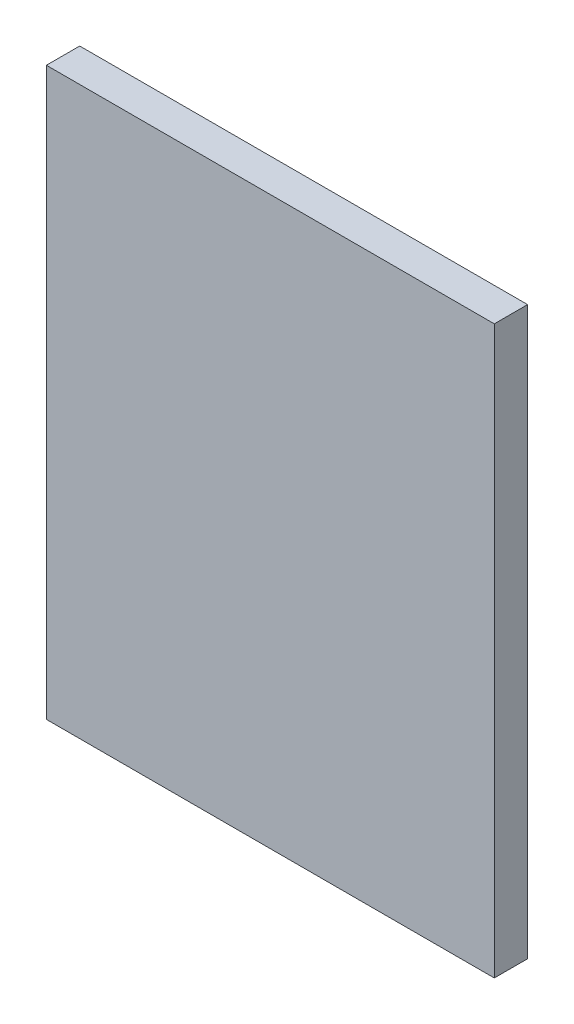
ISO-10303-21;
HEADER;
FILE_DESCRIPTION(('STEP AP214'),'2;1');
FILE_NAME('part.step','',(''),(''),'','','');
FILE_SCHEMA(('AUTOMOTIVE_DESIGN { 1 0 10303 214 1 1 1 1 }'));
ENDSEC;
DATA;
#1=APPLICATION_CONTEXT('core data for automotive mechanical design processes');
#2=APPLICATION_PROTOCOL_DEFINITION('international standard','automotive_design',2000,#1);
#3=PRODUCT_CONTEXT('',#1,'mechanical');
#4=PRODUCT('Part','Part','',(#3));
#5=PRODUCT_RELATED_PRODUCT_CATEGORY('part','',(#4));
#6=PRODUCT_DEFINITION_FORMATION('','',#4);
#7=PRODUCT_DEFINITION_CONTEXT('part definition',#1,'design');
#8=PRODUCT_DEFINITION('design','',#6,#7);
#9=PRODUCT_DEFINITION_SHAPE('','',#8);
#10=(LENGTH_UNIT() NAMED_UNIT(*) SI_UNIT(.MILLI.,.METRE.));
#11=(NAMED_UNIT(*) PLANE_ANGLE_UNIT() SI_UNIT($,.RADIAN.));
#12=(NAMED_UNIT(*) SI_UNIT($,.STERADIAN.) SOLID_ANGLE_UNIT());
#13=UNCERTAINTY_MEASURE_WITH_UNIT(LENGTH_MEASURE(1.E-05),#10,'distance_accuracy_value','');
#14=(GEOMETRIC_REPRESENTATION_CONTEXT(3) GLOBAL_UNCERTAINTY_ASSIGNED_CONTEXT((#13)) GLOBAL_UNIT_ASSIGNED_CONTEXT((#10,
#11,#12)) REPRESENTATION_CONTEXT('',''));
#15=CARTESIAN_POINT('',(0.,0.,0.));
#16=DIRECTION('',(0.,0.,1.));
#17=DIRECTION('',(1.,0.,0.));
#18=AXIS2_PLACEMENT_3D('',#15,#16,#17);
#19=CARTESIAN_POINT('',(21.336,-26.9875,1.5875));
#20=DIRECTION('',(-1.,0.,0.));
#21=DIRECTION('',(0.,0.,1.));
#22=AXIS2_PLACEMENT_3D('',#19,#20,#21);
#23=PLANE('',#22);
#24=DIRECTION('',(0.,1.,0.));
#25=VECTOR('',#24,1.);
#26=CARTESIAN_POINT('',(21.336,-26.9875,-1.5875));
#27=LINE('',#26,#25);
#28=CARTESIAN_POINT('',(21.336,-26.9875,-1.5875));
#29=VERTEX_POINT('',#28);
#30=CARTESIAN_POINT('',(21.336,26.9875,-1.5875));
#31=VERTEX_POINT('',#30);
#32=EDGE_CURVE('E96',#29,#31,#27,.T.);
#33=ORIENTED_EDGE('',*,*,#32,.T.);
#34=DIRECTION('',(0.,0.,-1.));
#35=VECTOR('',#34,1.);
#36=CARTESIAN_POINT('',(21.336,26.9875,1.5875));
#37=LINE('',#36,#35);
#38=CARTESIAN_POINT('',(21.336,26.9875,1.5875));
#39=VERTEX_POINT('',#38);
#40=EDGE_CURVE('E11',#39,#31,#37,.T.);
#41=ORIENTED_EDGE('',*,*,#40,.F.);
#42=DIRECTION('',(0.,1.,0.));
#43=VECTOR('',#42,1.);
#44=CARTESIAN_POINT('',(21.336,-26.9875,1.5875));
#45=LINE('',#44,#43);
#46=CARTESIAN_POINT('',(21.336,-26.9875,1.5875));
#47=VERTEX_POINT('',#46);
#48=EDGE_CURVE('E84',#47,#39,#45,.T.);
#49=ORIENTED_EDGE('',*,*,#48,.F.);
#50=DIRECTION('',(0.,0.,-1.));
#51=VECTOR('',#50,1.);
#52=CARTESIAN_POINT('',(21.336,-26.9875,1.5875));
#53=LINE('',#52,#51);
#54=EDGE_CURVE('E92',#47,#29,#53,.T.);
#55=ORIENTED_EDGE('',*,*,#54,.T.);
#56=EDGE_LOOP('',(#33,#41,#49,#55));
#57=FACE_BOUND('',#56,.T.);
#58=ADVANCED_FACE('F33',(#57),#23,.F.);
#59=CARTESIAN_POINT('',(-21.336,26.9875,1.5875));
#60=DIRECTION('',(0.,-1.,0.));
#61=DIRECTION('',(0.,0.,-1.));
#62=AXIS2_PLACEMENT_3D('',#59,#60,#61);
#63=PLANE('',#62);
#64=DIRECTION('',(-1.,0.,0.));
#65=VECTOR('',#64,1.);
#66=CARTESIAN_POINT('',(-21.336,26.9875,-1.5875));
#67=LINE('',#66,#65);
#68=CARTESIAN_POINT('',(-21.336,26.9875,-1.5875));
#69=VERTEX_POINT('',#68);
#70=EDGE_CURVE('E88',#31,#69,#67,.T.);
#71=ORIENTED_EDGE('',*,*,#70,.T.);
#72=DIRECTION('',(0.,0.,-1.));
#73=VECTOR('',#72,1.);
#74=CARTESIAN_POINT('',(-21.336,26.9875,1.5875));
#75=LINE('',#74,#73);
#76=CARTESIAN_POINT('',(-21.336,26.9875,1.5875));
#77=VERTEX_POINT('',#76);
#78=EDGE_CURVE('E41',#77,#69,#75,.T.);
#79=ORIENTED_EDGE('',*,*,#78,.F.);
#80=DIRECTION('',(-1.,0.,0.));
#81=VECTOR('',#80,1.);
#82=CARTESIAN_POINT('',(-21.336,26.9875,1.5875));
#83=LINE('',#82,#81);
#84=EDGE_CURVE('E79',#39,#77,#83,.T.);
#85=ORIENTED_EDGE('',*,*,#84,.F.);
#86=ORIENTED_EDGE('',*,*,#40,.T.);
#87=EDGE_LOOP('',(#71,#79,#85,#86));
#88=FACE_BOUND('',#87,.T.);
#89=ADVANCED_FACE('F87',(#88),#63,.F.);
#90=CARTESIAN_POINT('',(-21.336,-26.9875,1.5875));
#91=DIRECTION('',(1.,0.,0.));
#92=DIRECTION('',(0.,0.,-1.));
#93=AXIS2_PLACEMENT_3D('',#90,#91,#92);
#94=PLANE('',#93);
#95=DIRECTION('',(0.,-1.,0.));
#96=VECTOR('',#95,1.);
#97=CARTESIAN_POINT('',(-21.336,-26.9875,-1.5875));
#98=LINE('',#97,#96);
#99=CARTESIAN_POINT('',(-21.336,-26.9875,-1.5875));
#100=VERTEX_POINT('',#99);
#101=EDGE_CURVE('E66',#69,#100,#98,.T.);
#102=ORIENTED_EDGE('',*,*,#101,.T.);
#103=DIRECTION('',(0.,0.,-1.));
#104=VECTOR('',#103,1.);
#105=CARTESIAN_POINT('',(-21.336,-26.9875,1.5875));
#106=LINE('',#105,#104);
#107=CARTESIAN_POINT('',(-21.336,-26.9875,1.5875));
#108=VERTEX_POINT('',#107);
#109=EDGE_CURVE('E89',#108,#100,#106,.T.);
#110=ORIENTED_EDGE('',*,*,#109,.F.);
#111=DIRECTION('',(0.,-1.,0.));
#112=VECTOR('',#111,1.);
#113=CARTESIAN_POINT('',(-21.336,-26.9875,1.5875));
#114=LINE('',#113,#112);
#115=EDGE_CURVE('E82',#77,#108,#114,.T.);
#116=ORIENTED_EDGE('',*,*,#115,.F.);
#117=ORIENTED_EDGE('',*,*,#78,.T.);
#118=EDGE_LOOP('',(#102,#110,#116,#117));
#119=FACE_BOUND('',#118,.T.);
#120=ADVANCED_FACE('F90',(#119),#94,.F.);
#121=CARTESIAN_POINT('',(-21.336,-26.9875,1.5875));
#122=DIRECTION('',(0.,1.,0.));
#123=DIRECTION('',(0.,0.,1.));
#124=AXIS2_PLACEMENT_3D('',#121,#122,#123);
#125=PLANE('',#124);
#126=DIRECTION('',(1.,0.,0.));
#127=VECTOR('',#126,1.);
#128=CARTESIAN_POINT('',(-21.336,-26.9875,-1.5875));
#129=LINE('',#128,#127);
#130=EDGE_CURVE('E72',#100,#29,#129,.T.);
#131=ORIENTED_EDGE('',*,*,#130,.T.);
#132=ORIENTED_EDGE('',*,*,#54,.F.);
#133=DIRECTION('',(1.,0.,0.));
#134=VECTOR('',#133,1.);
#135=CARTESIAN_POINT('',(-21.336,-26.9875,1.5875));
#136=LINE('',#135,#134);
#137=EDGE_CURVE('E49',#108,#47,#136,.T.);
#138=ORIENTED_EDGE('',*,*,#137,.F.);
#139=ORIENTED_EDGE('',*,*,#109,.T.);
#140=EDGE_LOOP('',(#131,#132,#138,#139));
#141=FACE_BOUND('',#140,.T.);
#142=ADVANCED_FACE('F103',(#141),#125,.F.);
#143=CARTESIAN_POINT('',(0.,0.,1.5875));
#144=DIRECTION('',(0.,0.,-1.));
#145=DIRECTION('',(-1.,0.,0.));
#146=AXIS2_PLACEMENT_3D('',#143,#144,#145);
#147=PLANE('',#146);
#148=ORIENTED_EDGE('',*,*,#48,.T.);
#149=ORIENTED_EDGE('',*,*,#84,.T.);
#150=ORIENTED_EDGE('',*,*,#115,.T.);
#151=ORIENTED_EDGE('',*,*,#137,.T.);
#152=EDGE_LOOP('',(#148,#149,#150,#151));
#153=FACE_BOUND('',#152,.T.);
#154=ADVANCED_FACE('F80',(#153),#147,.F.);
#155=CARTESIAN_POINT('',(0.,0.,-1.5875));
#156=DIRECTION('',(0.,0.,-1.));
#157=DIRECTION('',(-1.,0.,0.));
#158=AXIS2_PLACEMENT_3D('',#155,#156,#157);
#159=PLANE('',#158);
#160=ORIENTED_EDGE('',*,*,#32,.F.);
#161=ORIENTED_EDGE('',*,*,#130,.F.);
#162=ORIENTED_EDGE('',*,*,#101,.F.);
#163=ORIENTED_EDGE('',*,*,#70,.F.);
#164=EDGE_LOOP('',(#160,#161,#162,#163));
#165=FACE_BOUND('',#164,.T.);
#166=ADVANCED_FACE('F106',(#165),#159,.T.);
#167=CLOSED_SHELL('',(#58,#89,#120,#142,#154,#166));
#168=MANIFOLD_SOLID_BREP('B2',#167);
#169=ADVANCED_BREP_SHAPE_REPRESENTATION('',(#18,#168),#14);
#170=SHAPE_DEFINITION_REPRESENTATION(#9,#169);
ENDSEC;
END-ISO-10303-21;
